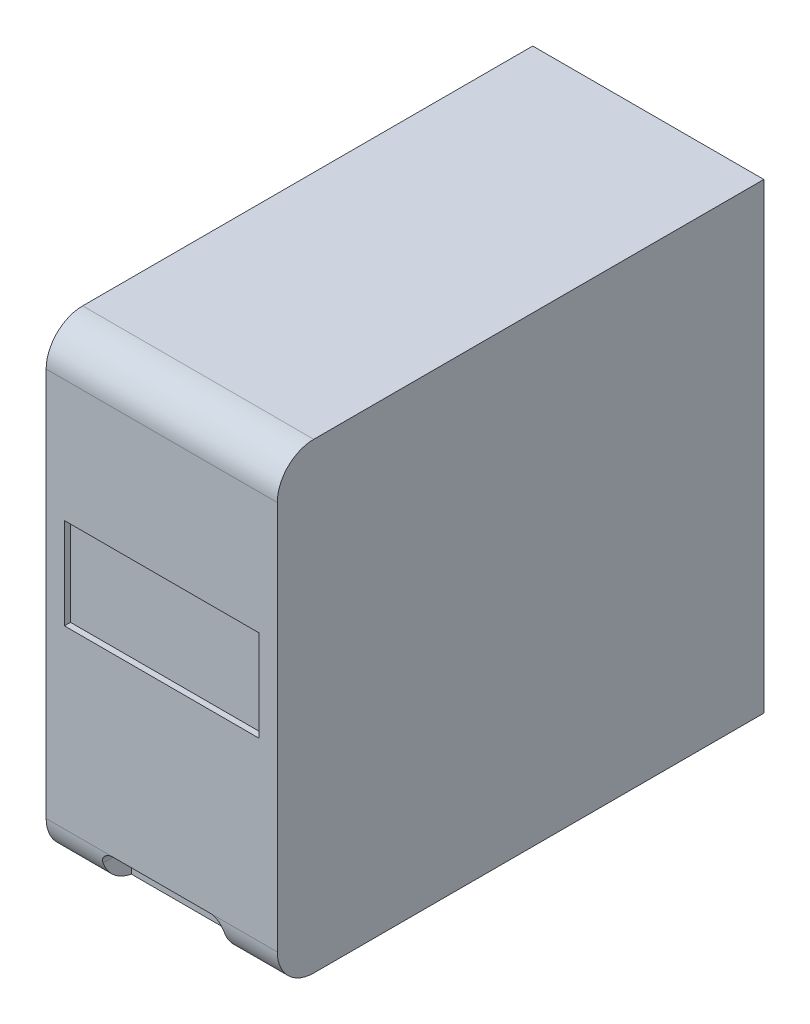
ISO-10303-21;
HEADER;
FILE_DESCRIPTION(('STEP AP214'),'2;1');
FILE_NAME('part.step','',(''),(''),'','','');
FILE_SCHEMA(('AUTOMOTIVE_DESIGN { 1 0 10303 214 1 1 1 1 }'));
ENDSEC;
DATA;
#1=APPLICATION_CONTEXT('core data for automotive mechanical design processes');
#2=APPLICATION_PROTOCOL_DEFINITION('international standard','automotive_design',2000,#1);
#3=PRODUCT_CONTEXT('',#1,'mechanical');
#4=PRODUCT('Part','Part','',(#3));
#5=PRODUCT_RELATED_PRODUCT_CATEGORY('part','',(#4));
#6=PRODUCT_DEFINITION_FORMATION('','',#4);
#7=PRODUCT_DEFINITION_CONTEXT('part definition',#1,'design');
#8=PRODUCT_DEFINITION('design','',#6,#7);
#9=PRODUCT_DEFINITION_SHAPE('','',#8);
#10=(LENGTH_UNIT() NAMED_UNIT(*) SI_UNIT(.MILLI.,.METRE.));
#11=(NAMED_UNIT(*) PLANE_ANGLE_UNIT() SI_UNIT($,.RADIAN.));
#12=(NAMED_UNIT(*) SI_UNIT($,.STERADIAN.) SOLID_ANGLE_UNIT());
#13=UNCERTAINTY_MEASURE_WITH_UNIT(LENGTH_MEASURE(1.E-05),#10,'distance_accuracy_value','');
#14=(GEOMETRIC_REPRESENTATION_CONTEXT(3) GLOBAL_UNCERTAINTY_ASSIGNED_CONTEXT((#13)) GLOBAL_UNIT_ASSIGNED_CONTEXT((#10,
#11,#12)) REPRESENTATION_CONTEXT('',''));
#15=CARTESIAN_POINT('',(0.,0.,0.));
#16=DIRECTION('',(0.,0.,1.));
#17=DIRECTION('',(1.,0.,0.));
#18=AXIS2_PLACEMENT_3D('',#15,#16,#17);
#19=CARTESIAN_POINT('',(95.,-190.,200.));
#20=DIRECTION('',(0.,0.,-1.));
#21=DIRECTION('',(-1.,0.,0.));
#22=AXIS2_PLACEMENT_3D('',#19,#20,#21);
#23=PLANE('',#22);
#24=DIRECTION('',(0.,-1.,0.));
#25=VECTOR('',#24,1.);
#26=CARTESIAN_POINT('',(-80.,0.,200.));
#27=LINE('',#26,#25);
#28=CARTESIAN_POINT('',(-80.,59.6719886433791,200.));
#29=VERTEX_POINT('',#28);
#30=CARTESIAN_POINT('',(-80.,-15.3280113566209,200.));
#31=VERTEX_POINT('',#30);
#32=EDGE_CURVE('E194',#29,#31,#27,.T.);
#33=ORIENTED_EDGE('',*,*,#32,.F.);
#34=DIRECTION('',(-1.,0.,0.));
#35=VECTOR('',#34,1.);
#36=CARTESIAN_POINT('',(0.,59.6719886433791,200.));
#37=LINE('',#36,#35);
#38=CARTESIAN_POINT('',(80.,59.6719886433791,200.));
#39=VERTEX_POINT('',#38);
#40=EDGE_CURVE('E60',#39,#29,#37,.T.);
#41=ORIENTED_EDGE('',*,*,#40,.F.);
#42=DIRECTION('',(0.,-1.,0.));
#43=VECTOR('',#42,1.);
#44=CARTESIAN_POINT('',(80.,0.,200.));
#45=LINE('',#44,#43);
#46=CARTESIAN_POINT('',(80.,-15.3280113566209,200.));
#47=VERTEX_POINT('',#46);
#48=EDGE_CURVE('E185',#39,#47,#45,.T.);
#49=ORIENTED_EDGE('',*,*,#48,.T.);
#50=DIRECTION('',(-1.,0.,0.));
#51=VECTOR('',#50,1.);
#52=CARTESIAN_POINT('',(0.,-15.3280113566209,200.));
#53=LINE('',#52,#51);
#54=EDGE_CURVE('E197',#47,#31,#53,.T.);
#55=ORIENTED_EDGE('',*,*,#54,.T.);
#56=EDGE_LOOP('',(#33,#41,#49,#55));
#57=FACE_BOUND('',#56,.T.);
#58=DIRECTION('',(0.,-1.,0.));
#59=VECTOR('',#58,1.);
#60=CARTESIAN_POINT('',(-95.,-190.,200.));
#61=LINE('',#60,#59);
#62=CARTESIAN_POINT('',(-95.,160.,200.));
#63=VERTEX_POINT('',#62);
#64=CARTESIAN_POINT('',(-95.,-160.,200.));
#65=VERTEX_POINT('',#64);
#66=EDGE_CURVE('E204',#63,#65,#61,.T.);
#67=ORIENTED_EDGE('',*,*,#66,.T.);
#68=DIRECTION('',(-1.,0.,0.));
#69=VECTOR('',#68,1.);
#70=CARTESIAN_POINT('',(95.,-160.,200.));
#71=LINE('',#70,#69);
#72=CARTESIAN_POINT('',(-40.,-160.,200.));
#73=VERTEX_POINT('',#72);
#74=EDGE_CURVE('E246',#65,#73,#71,.F.);
#75=ORIENTED_EDGE('',*,*,#74,.T.);
#76=DIRECTION('',(-1.,0.,0.));
#77=VECTOR('',#76,1.);
#78=CARTESIAN_POINT('',(40.,-160.,200.));
#79=LINE('',#78,#77);
#80=CARTESIAN_POINT('',(40.,-160.,200.));
#81=VERTEX_POINT('',#80);
#82=EDGE_CURVE('E155',#81,#73,#79,.T.);
#83=ORIENTED_EDGE('',*,*,#82,.F.);
#84=CARTESIAN_POINT('',(95.,-160.,200.));
#85=VERTEX_POINT('',#84);
#86=EDGE_CURVE('E245',#81,#85,#71,.F.);
#87=ORIENTED_EDGE('',*,*,#86,.T.);
#88=DIRECTION('',(0.,-1.,0.));
#89=VECTOR('',#88,1.);
#90=CARTESIAN_POINT('',(95.,-190.,200.));
#91=LINE('',#90,#89);
#92=CARTESIAN_POINT('',(95.,160.,200.));
#93=VERTEX_POINT('',#92);
#94=EDGE_CURVE('E210',#93,#85,#91,.T.);
#95=ORIENTED_EDGE('',*,*,#94,.F.);
#96=DIRECTION('',(-1.,0.,0.));
#97=VECTOR('',#96,1.);
#98=CARTESIAN_POINT('',(95.,160.,200.));
#99=LINE('',#98,#97);
#100=EDGE_CURVE('E242',#93,#63,#99,.T.);
#101=ORIENTED_EDGE('',*,*,#100,.T.);
#102=EDGE_LOOP('',(#67,#75,#83,#87,#95,#101));
#103=FACE_BOUND('',#102,.T.);
#104=ADVANCED_FACE('F33',(#57,#103),#23,.F.);
#105=CARTESIAN_POINT('',(95.,-190.,-200.));
#106=DIRECTION('',(0.,1.,0.));
#107=DIRECTION('',(0.,0.,1.));
#108=AXIS2_PLACEMENT_3D('',#105,#106,#107);
#109=PLANE('',#108);
#110=DIRECTION('',(0.,0.,-1.));
#111=VECTOR('',#110,1.);
#112=CARTESIAN_POINT('',(95.,-190.,-200.));
#113=LINE('',#112,#111);
#114=CARTESIAN_POINT('',(95.,-190.,170.));
#115=VERTEX_POINT('',#114);
#116=CARTESIAN_POINT('',(95.,-190.,-200.));
#117=VERTEX_POINT('',#116);
#118=EDGE_CURVE('E213',#115,#117,#113,.T.);
#119=ORIENTED_EDGE('',*,*,#118,.F.);
#120=DIRECTION('',(-1.,0.,0.));
#121=VECTOR('',#120,1.);
#122=CARTESIAN_POINT('',(95.,-190.,170.));
#123=LINE('',#122,#121);
#124=CARTESIAN_POINT('',(-95.,-190.,170.));
#125=VERTEX_POINT('',#124);
#126=EDGE_CURVE('E235',#115,#125,#123,.T.);
#127=ORIENTED_EDGE('',*,*,#126,.T.);
#128=DIRECTION('',(0.,0.,-1.));
#129=VECTOR('',#128,1.);
#130=CARTESIAN_POINT('',(-95.,-190.,-200.));
#131=LINE('',#130,#129);
#132=CARTESIAN_POINT('',(-95.,-190.,-200.));
#133=VERTEX_POINT('',#132);
#134=EDGE_CURVE('E224',#125,#133,#131,.T.);
#135=ORIENTED_EDGE('',*,*,#134,.T.);
#136=DIRECTION('',(-1.,0.,0.));
#137=VECTOR('',#136,1.);
#138=CARTESIAN_POINT('',(95.,-190.,-200.));
#139=LINE('',#138,#137);
#140=EDGE_CURVE('E232',#117,#133,#139,.T.);
#141=ORIENTED_EDGE('',*,*,#140,.F.);
#142=EDGE_LOOP('',(#119,#127,#135,#141));
#143=FACE_BOUND('',#142,.T.);
#144=ADVANCED_FACE('F307',(#143),#109,.F.);
#145=CARTESIAN_POINT('',(95.,-190.,-200.));
#146=DIRECTION('',(0.,0.,1.));
#147=DIRECTION('',(1.,0.,0.));
#148=AXIS2_PLACEMENT_3D('',#145,#146,#147);
#149=PLANE('',#148);
#150=DIRECTION('',(0.,1.,0.));
#151=VECTOR('',#150,1.);
#152=CARTESIAN_POINT('',(-95.,-190.,-200.));
#153=LINE('',#152,#151);
#154=CARTESIAN_POINT('',(-95.,190.,-200.));
#155=VERTEX_POINT('',#154);
#156=EDGE_CURVE('E226',#133,#155,#153,.T.);
#157=ORIENTED_EDGE('',*,*,#156,.T.);
#158=DIRECTION('',(-1.,0.,0.));
#159=VECTOR('',#158,1.);
#160=CARTESIAN_POINT('',(95.,190.,-200.));
#161=LINE('',#160,#159);
#162=CARTESIAN_POINT('',(95.,190.,-200.));
#163=VERTEX_POINT('',#162);
#164=EDGE_CURVE('E221',#163,#155,#161,.T.);
#165=ORIENTED_EDGE('',*,*,#164,.F.);
#166=DIRECTION('',(0.,1.,0.));
#167=VECTOR('',#166,1.);
#168=CARTESIAN_POINT('',(95.,-190.,-200.));
#169=LINE('',#168,#167);
#170=EDGE_CURVE('E216',#117,#163,#169,.T.);
#171=ORIENTED_EDGE('',*,*,#170,.F.);
#172=ORIENTED_EDGE('',*,*,#140,.T.);
#173=EDGE_LOOP('',(#157,#165,#171,#172));
#174=FACE_BOUND('',#173,.T.);
#175=ADVANCED_FACE('F303',(#174),#149,.F.);
#176=CARTESIAN_POINT('',(95.,190.,-200.));
#177=DIRECTION('',(0.,-1.,0.));
#178=DIRECTION('',(0.,0.,-1.));
#179=AXIS2_PLACEMENT_3D('',#176,#177,#178);
#180=PLANE('',#179);
#181=DIRECTION('',(0.,0.,1.));
#182=VECTOR('',#181,1.);
#183=CARTESIAN_POINT('',(-95.,190.,-200.));
#184=LINE('',#183,#182);
#185=CARTESIAN_POINT('',(-95.,190.,170.));
#186=VERTEX_POINT('',#185);
#187=EDGE_CURVE('E214',#155,#186,#184,.T.);
#188=ORIENTED_EDGE('',*,*,#187,.T.);
#189=DIRECTION('',(-1.,0.,0.));
#190=VECTOR('',#189,1.);
#191=CARTESIAN_POINT('',(95.,190.,170.));
#192=LINE('',#191,#190);
#193=CARTESIAN_POINT('',(95.,190.,170.));
#194=VERTEX_POINT('',#193);
#195=EDGE_CURVE('E253',#186,#194,#192,.F.);
#196=ORIENTED_EDGE('',*,*,#195,.T.);
#197=DIRECTION('',(0.,0.,1.));
#198=VECTOR('',#197,1.);
#199=CARTESIAN_POINT('',(95.,190.,-200.));
#200=LINE('',#199,#198);
#201=EDGE_CURVE('E218',#163,#194,#200,.T.);
#202=ORIENTED_EDGE('',*,*,#201,.F.);
#203=ORIENTED_EDGE('',*,*,#164,.T.);
#204=EDGE_LOOP('',(#188,#196,#202,#203));
#205=FACE_BOUND('',#204,.T.);
#206=ADVANCED_FACE('F296',(#205),#180,.F.);
#207=CARTESIAN_POINT('',(95.,0.,0.));
#208=DIRECTION('',(1.,0.,0.));
#209=DIRECTION('',(0.,0.,-1.));
#210=AXIS2_PLACEMENT_3D('',#207,#208,#209);
#211=PLANE('',#210);
#212=ORIENTED_EDGE('',*,*,#94,.T.);
#213=CARTESIAN_POINT('',(95.,-160.,170.));
#214=DIRECTION('',(1.,0.,0.));
#215=DIRECTION('',(0.,0.,-1.));
#216=AXIS2_PLACEMENT_3D('',#213,#214,#215);
#217=CIRCLE('',#216,30.);
#218=EDGE_CURVE('E251',#85,#115,#217,.T.);
#219=ORIENTED_EDGE('',*,*,#218,.T.);
#220=ORIENTED_EDGE('',*,*,#118,.T.);
#221=ORIENTED_EDGE('',*,*,#170,.T.);
#222=ORIENTED_EDGE('',*,*,#201,.T.);
#223=CARTESIAN_POINT('',(95.,160.,170.));
#224=DIRECTION('',(1.,0.,0.));
#225=DIRECTION('',(0.,0.,-1.));
#226=AXIS2_PLACEMENT_3D('',#223,#224,#225);
#227=CIRCLE('',#226,30.);
#228=EDGE_CURVE('E249',#194,#93,#227,.T.);
#229=ORIENTED_EDGE('',*,*,#228,.T.);
#230=EDGE_LOOP('',(#212,#219,#220,#221,#222,#229));
#231=FACE_BOUND('',#230,.T.);
#232=ADVANCED_FACE('F292',(#231),#211,.T.);
#233=CARTESIAN_POINT('',(-95.,0.,0.));
#234=DIRECTION('',(1.,0.,0.));
#235=DIRECTION('',(0.,0.,-1.));
#236=AXIS2_PLACEMENT_3D('',#233,#234,#235);
#237=PLANE('',#236);
#238=ORIENTED_EDGE('',*,*,#134,.F.);
#239=CARTESIAN_POINT('',(-95.,-160.,170.));
#240=DIRECTION('',(1.,0.,0.));
#241=DIRECTION('',(0.,0.,-1.));
#242=AXIS2_PLACEMENT_3D('',#239,#240,#241);
#243=CIRCLE('',#242,30.);
#244=EDGE_CURVE('E240',#125,#65,#243,.F.);
#245=ORIENTED_EDGE('',*,*,#244,.T.);
#246=ORIENTED_EDGE('',*,*,#66,.F.);
#247=CARTESIAN_POINT('',(-95.,160.,170.));
#248=DIRECTION('',(1.,0.,0.));
#249=DIRECTION('',(0.,0.,-1.));
#250=AXIS2_PLACEMENT_3D('',#247,#248,#249);
#251=CIRCLE('',#250,30.);
#252=EDGE_CURVE('E238',#63,#186,#251,.F.);
#253=ORIENTED_EDGE('',*,*,#252,.T.);
#254=ORIENTED_EDGE('',*,*,#187,.F.);
#255=ORIENTED_EDGE('',*,*,#156,.F.);
#256=EDGE_LOOP('',(#238,#245,#246,#253,#254,#255));
#257=FACE_BOUND('',#256,.T.);
#258=ADVANCED_FACE('F295',(#257),#237,.F.);
#259=CARTESIAN_POINT('',(95.,-160.,170.));
#260=DIRECTION('',(-1.,0.,0.));
#261=DIRECTION('',(0.,0.,1.));
#262=AXIS2_PLACEMENT_3D('',#259,#260,#261);
#263=CYLINDRICAL_SURFACE('',#262,30.);
#264=CARTESIAN_POINT('',(-40.,-160.,200.));
#265=CARTESIAN_POINT('',(-40.28095100053,-159.999969889423,199.999970330303));
#266=CARTESIAN_POINT('',(-40.5618977001833,-160.011838758226,199.999999068018));
#267=CARTESIAN_POINT('',(-41.1217866671126,-160.059157077855,199.999958929646));
#268=CARTESIAN_POINT('',(-41.400729020641,-160.09460550777,199.999890057785));
#269=CARTESIAN_POINT('',(-41.9544831051373,-160.188839225973,199.999440432078));
#270=CARTESIAN_POINT('',(-42.2292970608852,-160.247611439966,199.999059852834));
#271=CARTESIAN_POINT('',(-42.7730013547145,-160.388065422842,199.997572677254));
#272=CARTESIAN_POINT('',(-43.0418917655821,-160.469746910056,199.996466089844));
#273=CARTESIAN_POINT('',(-43.5719882637669,-160.655492403126,199.992981619503));
#274=CARTESIAN_POINT('',(-43.8331899896401,-160.759568844708,199.990603029144));
#275=CARTESIAN_POINT('',(-44.3458845871562,-160.989328748389,199.983902864841));
#276=CARTESIAN_POINT('',(-44.5973775254464,-161.115012062132,199.979581304236));
#277=CARTESIAN_POINT('',(-45.088812856191,-161.387053319962,199.968226569172));
#278=CARTESIAN_POINT('',(-45.3287568877028,-161.53340831859,199.961193780783));
#279=CARTESIAN_POINT('',(-45.7953913314118,-161.845721475575,199.943576328422));
#280=CARTESIAN_POINT('',(-46.0220818843529,-162.011679425704,199.932991702177));
#281=CARTESIAN_POINT('',(-46.4595451002094,-162.361133063608,199.907450405961));
#282=CARTESIAN_POINT('',(-46.6703862162291,-162.5445445281,199.892514080274));
#283=CARTESIAN_POINT('',(-47.0757636311216,-162.928123838934,199.857380488216));
#284=CARTESIAN_POINT('',(-47.2702999134347,-163.128291702293,199.837183216501));
#285=CARTESIAN_POINT('',(-47.6416139501458,-163.543736774259,199.790696471024));
#286=CARTESIAN_POINT('',(-47.8183957163205,-163.759010550804,199.764408377992));
#287=CARTESIAN_POINT('',(-48.1529906694208,-164.202932425007,199.704974198699));
#288=CARTESIAN_POINT('',(-48.3108043985026,-164.431580140125,199.671828308525));
#289=CARTESIAN_POINT('',(-48.6036074126578,-164.895899057553,199.598722153749));
#290=CARTESIAN_POINT('',(-48.7389712006718,-165.131356310949,199.558902278641));
#291=CARTESIAN_POINT('',(-48.9896150429259,-165.611363861628,199.471547180037));
#292=CARTESIAN_POINT('',(-49.1048945592361,-165.855914402251,199.424011749956));
#293=CARTESIAN_POINT('',(-49.3148072998489,-166.352129269028,199.320891601089));
#294=CARTESIAN_POINT('',(-49.4094363048133,-166.603795037132,199.26530524118));
#295=CARTESIAN_POINT('',(-49.5776731254438,-167.11212384551,199.145939987937));
#296=CARTESIAN_POINT('',(-49.6512843085371,-167.368786078217,199.082162409357));
#297=CARTESIAN_POINT('',(-49.7624038787947,-167.82364796698,198.962595761663));
#298=CARTESIAN_POINT('',(-49.8043349470949,-168.021232375529,198.908514871608));
#299=CARTESIAN_POINT('',(-49.8760023344919,-168.417261695051,198.795695656681));
#300=CARTESIAN_POINT('',(-49.9057401539366,-168.615706497117,198.736957905887));
#301=CARTESIAN_POINT('',(-49.9531001112375,-169.012276749848,198.615062171224));
#302=CARTESIAN_POINT('',(-49.9707440795928,-169.210402128463,198.551912379845));
#303=CARTESIAN_POINT('',(-49.994198630746,-169.605932979501,198.421287750671));
#304=CARTESIAN_POINT('',(-50.0000089682899,-169.803338436918,198.353812823267));
#305=CARTESIAN_POINT('',(-50.,-170.,198.284271247462));
#306=B_SPLINE_CURVE_WITH_KNOTS('',3,(#264,#265,#266,#267,#268,#269,#270,#271,#272,#273,#274,
#275,#276,#277,#278,#279,#280,#281,#282,#283,#284,#285,#286,#287,#288,#289,#290,#291,#292,#293,
#294,#295,#296,#297,#298,#299,#300,#301,#302,#303,#304,#305),.UNSPECIFIED.,.F.,.F.,(4,2,2,2,2,2,
2,2,2,2,2,2,2,2,2,2,2,2,2,2,4),(0.,0.842596347235416,1.68515621545009,2.52724444704607,
3.36932232562103,4.21186901508965,5.0544099197368,5.8968308935731,6.73924291978504,
7.57777817081019,8.41631427345932,9.25466047376526,10.0929827062405,10.9154858227551,
11.7380109655107,12.5607040106039,13.3832651716468,14.0101734935271,14.6370046527931,
15.2627013239029,15.8884109625542),.UNSPECIFIED.);
#307=CARTESIAN_POINT('',(-50.,-170.,198.284271247462));
#308=VERTEX_POINT('',#307);
#309=EDGE_CURVE('E11',#73,#308,#306,.T.);
#310=ORIENTED_EDGE('',*,*,#309,.F.);
#311=ORIENTED_EDGE('',*,*,#74,.F.);
#312=ORIENTED_EDGE('',*,*,#244,.F.);
#313=ORIENTED_EDGE('',*,*,#126,.F.);
#314=ORIENTED_EDGE('',*,*,#218,.F.);
#315=ORIENTED_EDGE('',*,*,#86,.F.);
#316=CARTESIAN_POINT('',(50.,-170.,198.284271247462));
#317=CARTESIAN_POINT('',(50.0000320928327,-169.736208972423,198.377572886787));
#318=CARTESIAN_POINT('',(49.989562346357,-169.471050423097,198.467132414141));
#319=CARTESIAN_POINT('',(49.9472048255618,-168.939825708577,198.638380802605));
#320=CARTESIAN_POINT('',(49.9153109035706,-168.673759304684,198.720067396879));
#321=CARTESIAN_POINT('',(49.8296857842549,-168.14267260188,198.875137420559));
#322=CARTESIAN_POINT('',(49.7759523381867,-167.877652413532,198.948519993931));
#323=CARTESIAN_POINT('',(49.6465175393751,-167.350800262793,199.086764351863));
#324=CARTESIAN_POINT('',(49.570818792215,-167.088967926087,199.151627145736));
#325=CARTESIAN_POINT('',(49.3973545406745,-166.570022628021,199.272956528182));
#326=CARTESIAN_POINT('',(49.2995394243366,-166.3129217045,199.329403758947));
#327=CARTESIAN_POINT('',(49.0823131954279,-165.80624748487,199.433898889602));
#328=CARTESIAN_POINT('',(48.9629024402555,-165.556674064265,199.481946928468));
#329=CARTESIAN_POINT('',(48.7032154510401,-165.067384452854,199.569974129532));
#330=CARTESIAN_POINT('',(48.562954529976,-164.827661191351,199.609959163075));
#331=CARTESIAN_POINT('',(48.2623872891451,-164.359944408242,199.682434137817));
#332=CARTESIAN_POINT('',(48.1020816016482,-164.131950516977,199.714924315335));
#333=CARTESIAN_POINT('',(47.7672723589595,-163.695799684116,199.772270648436));
#334=CARTESIAN_POINT('',(47.5932906284361,-163.487266481761,199.797314733996));
#335=CARTESIAN_POINT('',(47.2286049076774,-163.084725001836,199.841673586902));
#336=CARTESIAN_POINT('',(47.0379011390645,-162.890716531828,199.860988430166));
#337=CARTESIAN_POINT('',(46.641007314041,-162.518619893645,199.894673054857));
#338=CARTESIAN_POINT('',(46.43481123548,-162.340537975951,199.909040901052));
#339=CARTESIAN_POINT('',(46.0084241548038,-162.001687820095,199.933628450655));
#340=CARTESIAN_POINT('',(45.7882330930205,-161.840919655758,199.943848136375));
#341=CARTESIAN_POINT('',(45.3329759922878,-161.536243137958,199.96103291897));
#342=CARTESIAN_POINT('',(45.0977773115031,-161.392530982555,199.967962468242));
#343=CARTESIAN_POINT('',(44.616272250787,-161.12498518072,199.97919853529));
#344=CARTESIAN_POINT('',(44.3699657566459,-161.001151738739,199.983505026089));
#345=CARTESIAN_POINT('',(43.8680200167025,-160.774260737807,199.990221809384));
#346=CARTESIAN_POINT('',(43.6123831898947,-160.671197838417,199.992632589761));
#347=CARTESIAN_POINT('',(43.0934921837441,-160.486529594857,199.996196930315));
#348=CARTESIAN_POINT('',(42.8302391386293,-160.404921073716,199.997350676713));
#349=CARTESIAN_POINT('',(42.3551175301922,-160.278879409757,199.998754670982));
#350=CARTESIAN_POINT('',(42.1443572060037,-160.230226355665,199.999145753508));
#351=CARTESIAN_POINT('',(41.7201484264248,-160.14668529873,199.999670381541));
#352=CARTESIAN_POINT('',(41.5067003750377,-160.111795252011,199.999803965301));
#353=CARTESIAN_POINT('',(41.0781796967767,-160.055948318897,199.999961551061));
#354=CARTESIAN_POINT('',(40.8631086358938,-160.034979399284,199.999985647806));
#355=CARTESIAN_POINT('',(40.4320259364395,-160.006998993898,199.999999666965));
#356=CARTESIAN_POINT('',(40.2160141521956,-159.999989752839,199.999989583885));
#357=CARTESIAN_POINT('',(40.,-160.,200.));
#358=B_SPLINE_CURVE_WITH_KNOTS('',3,(#316,#317,#318,#319,#320,#321,#322,#323,#324,#325,#326,
#327,#328,#329,#330,#331,#332,#333,#334,#335,#336,#337,#338,#339,#340,#341,#342,#343,#344,#345,
#346,#347,#348,#349,#350,#351,#352,#353,#354,#355,#356,#357),.UNSPECIFIED.,.F.,.F.,(4,2,2,2,2,2,
2,2,2,2,2,2,2,2,2,2,2,2,2,2,4),(0.,0.839252815331729,1.67874655737015,2.51832676121381,
3.35780741247371,4.19919022565456,5.04055911559604,5.8813131046223,6.72204058051576,
7.539278325486,8.35650524099357,9.17405148798559,9.991601220844,10.817793586409,
11.6439944487636,12.4699826098721,13.29584838941,13.9443264567143,14.592708185397,
15.2405287302226,15.8884534360988),.UNSPECIFIED.);
#359=CARTESIAN_POINT('',(50.,-170.,198.284271247462));
#360=VERTEX_POINT('',#359);
#361=EDGE_CURVE('E257',#360,#81,#358,.T.);
#362=ORIENTED_EDGE('',*,*,#361,.F.);
#363=CARTESIAN_POINT('',(50.,-160.,170.));
#364=DIRECTION('',(1.,0.,0.));
#365=DIRECTION('',(0.,1.,0.));
#366=AXIS2_PLACEMENT_3D('',#363,#364,#365);
#367=CIRCLE('',#366,30.);
#368=CARTESIAN_POINT('',(50.,-189.580398915498,175.));
#369=VERTEX_POINT('',#368);
#370=EDGE_CURVE('E160',#369,#360,#367,.F.);
#371=ORIENTED_EDGE('',*,*,#370,.F.);
#372=DIRECTION('',(-1.,0.,0.));
#373=VECTOR('',#372,1.);
#374=CARTESIAN_POINT('',(95.,-189.580398915498,175.));
#375=LINE('',#374,#373);
#376=CARTESIAN_POINT('',(-50.,-189.580398915498,175.));
#377=VERTEX_POINT('',#376);
#378=EDGE_CURVE('E152',#369,#377,#375,.T.);
#379=ORIENTED_EDGE('',*,*,#378,.T.);
#380=CARTESIAN_POINT('',(-50.,-160.,170.));
#381=DIRECTION('',(-1.,0.,0.));
#382=DIRECTION('',(0.,0.,1.));
#383=AXIS2_PLACEMENT_3D('',#380,#381,#382);
#384=CIRCLE('',#383,30.);
#385=EDGE_CURVE('E45',#308,#377,#384,.F.);
#386=ORIENTED_EDGE('',*,*,#385,.F.);
#387=EDGE_LOOP('',(#310,#311,#312,#313,#314,#315,#362,#371,#379,#386));
#388=FACE_BOUND('',#387,.T.);
#389=ADVANCED_FACE('F262',(#388),#263,.T.);
#390=CARTESIAN_POINT('',(95.,160.,170.));
#391=DIRECTION('',(-1.,0.,0.));
#392=DIRECTION('',(0.,0.,1.));
#393=AXIS2_PLACEMENT_3D('',#390,#391,#392);
#394=CYLINDRICAL_SURFACE('',#393,30.);
#395=ORIENTED_EDGE('',*,*,#228,.F.);
#396=ORIENTED_EDGE('',*,*,#195,.F.);
#397=ORIENTED_EDGE('',*,*,#252,.F.);
#398=ORIENTED_EDGE('',*,*,#100,.F.);
#399=EDGE_LOOP('',(#395,#396,#397,#398));
#400=FACE_BOUND('',#399,.T.);
#401=ADVANCED_FACE('F35',(#400),#394,.T.);
#402=CARTESIAN_POINT('',(0.,59.6719886433791,195.));
#403=DIRECTION('',(0.,1.,0.));
#404=DIRECTION('',(-1.,0.,0.));
#405=AXIS2_PLACEMENT_3D('',#402,#403,#404);
#406=PLANE('',#405);
#407=ORIENTED_EDGE('',*,*,#40,.T.);
#408=DIRECTION('',(0.,0.,1.));
#409=VECTOR('',#408,1.);
#410=CARTESIAN_POINT('',(-80.,59.6719886433791,195.));
#411=LINE('',#410,#409);
#412=CARTESIAN_POINT('',(-80.,59.6719886433791,195.));
#413=VERTEX_POINT('',#412);
#414=EDGE_CURVE('E192',#413,#29,#411,.T.);
#415=ORIENTED_EDGE('',*,*,#414,.F.);
#416=DIRECTION('',(-1.,0.,0.));
#417=VECTOR('',#416,1.);
#418=CARTESIAN_POINT('',(0.,59.6719886433791,195.));
#419=LINE('',#418,#417);
#420=CARTESIAN_POINT('',(80.,59.6719886433791,195.));
#421=VERTEX_POINT('',#420);
#422=EDGE_CURVE('E181',#421,#413,#419,.T.);
#423=ORIENTED_EDGE('',*,*,#422,.F.);
#424=DIRECTION('',(0.,0.,1.));
#425=VECTOR('',#424,1.);
#426=CARTESIAN_POINT('',(80.,59.6719886433791,195.));
#427=LINE('',#426,#425);
#428=EDGE_CURVE('E202',#421,#39,#427,.T.);
#429=ORIENTED_EDGE('',*,*,#428,.T.);
#430=EDGE_LOOP('',(#407,#415,#423,#429));
#431=FACE_BOUND('',#430,.T.);
#432=ADVANCED_FACE('F282',(#431),#406,.F.);
#433=CARTESIAN_POINT('',(80.,0.,195.));
#434=DIRECTION('',(-1.,0.,0.));
#435=DIRECTION('',(0.,-1.,0.));
#436=AXIS2_PLACEMENT_3D('',#433,#434,#435);
#437=PLANE('',#436);
#438=ORIENTED_EDGE('',*,*,#48,.F.);
#439=ORIENTED_EDGE('',*,*,#428,.F.);
#440=DIRECTION('',(0.,-1.,0.));
#441=VECTOR('',#440,1.);
#442=CARTESIAN_POINT('',(80.,0.,195.));
#443=LINE('',#442,#441);
#444=CARTESIAN_POINT('',(80.,-15.3280113566209,195.));
#445=VERTEX_POINT('',#444);
#446=EDGE_CURVE('E190',#421,#445,#443,.T.);
#447=ORIENTED_EDGE('',*,*,#446,.T.);
#448=DIRECTION('',(0.,0.,1.));
#449=VECTOR('',#448,1.);
#450=CARTESIAN_POINT('',(80.,-15.3280113566209,195.));
#451=LINE('',#450,#449);
#452=EDGE_CURVE('E205',#445,#47,#451,.T.);
#453=ORIENTED_EDGE('',*,*,#452,.T.);
#454=EDGE_LOOP('',(#438,#439,#447,#453));
#455=FACE_BOUND('',#454,.T.);
#456=ADVANCED_FACE('F278',(#455),#437,.T.);
#457=CARTESIAN_POINT('',(0.,-15.3280113566209,195.));
#458=DIRECTION('',(0.,1.,0.));
#459=DIRECTION('',(-1.,0.,0.));
#460=AXIS2_PLACEMENT_3D('',#457,#458,#459);
#461=PLANE('',#460);
#462=ORIENTED_EDGE('',*,*,#54,.F.);
#463=ORIENTED_EDGE('',*,*,#452,.F.);
#464=DIRECTION('',(-1.,0.,0.));
#465=VECTOR('',#464,1.);
#466=CARTESIAN_POINT('',(0.,-15.3280113566209,195.));
#467=LINE('',#466,#465);
#468=CARTESIAN_POINT('',(-80.,-15.3280113566209,195.));
#469=VERTEX_POINT('',#468);
#470=EDGE_CURVE('E188',#445,#469,#467,.T.);
#471=ORIENTED_EDGE('',*,*,#470,.T.);
#472=DIRECTION('',(0.,0.,1.));
#473=VECTOR('',#472,1.);
#474=CARTESIAN_POINT('',(-80.,-15.3280113566209,195.));
#475=LINE('',#474,#473);
#476=EDGE_CURVE('E207',#469,#31,#475,.T.);
#477=ORIENTED_EDGE('',*,*,#476,.T.);
#478=EDGE_LOOP('',(#462,#463,#471,#477));
#479=FACE_BOUND('',#478,.T.);
#480=ADVANCED_FACE('F281',(#479),#461,.T.);
#481=CARTESIAN_POINT('',(-80.,0.,195.));
#482=DIRECTION('',(-1.,0.,0.));
#483=DIRECTION('',(0.,-1.,0.));
#484=AXIS2_PLACEMENT_3D('',#481,#482,#483);
#485=PLANE('',#484);
#486=ORIENTED_EDGE('',*,*,#32,.T.);
#487=ORIENTED_EDGE('',*,*,#476,.F.);
#488=DIRECTION('',(0.,-1.,0.));
#489=VECTOR('',#488,1.);
#490=CARTESIAN_POINT('',(-80.,0.,195.));
#491=LINE('',#490,#489);
#492=EDGE_CURVE('E184',#413,#469,#491,.T.);
#493=ORIENTED_EDGE('',*,*,#492,.F.);
#494=ORIENTED_EDGE('',*,*,#414,.T.);
#495=EDGE_LOOP('',(#486,#487,#493,#494));
#496=FACE_BOUND('',#495,.T.);
#497=ADVANCED_FACE('F276',(#496),#485,.F.);
#498=CARTESIAN_POINT('',(0.,0.,195.));
#499=DIRECTION('',(0.,0.,1.));
#500=DIRECTION('',(1.,0.,0.));
#501=AXIS2_PLACEMENT_3D('',#498,#499,#500);
#502=PLANE('',#501);
#503=ORIENTED_EDGE('',*,*,#422,.T.);
#504=ORIENTED_EDGE('',*,*,#492,.T.);
#505=ORIENTED_EDGE('',*,*,#470,.F.);
#506=ORIENTED_EDGE('',*,*,#446,.F.);
#507=EDGE_LOOP('',(#503,#504,#505,#506));
#508=FACE_BOUND('',#507,.T.);
#509=ADVANCED_FACE('F272',(#508),#502,.T.);
#510=CARTESIAN_POINT('',(-50.,-170.,175.));
#511=DIRECTION('',(-1.,0.,0.));
#512=DIRECTION('',(0.,0.,1.));
#513=AXIS2_PLACEMENT_3D('',#510,#511,#512);
#514=PLANE('',#513);
#515=ORIENTED_EDGE('',*,*,#385,.T.);
#516=DIRECTION('',(0.,-1.,0.));
#517=VECTOR('',#516,1.);
#518=CARTESIAN_POINT('',(-50.,-170.,175.));
#519=LINE('',#518,#517);
#520=CARTESIAN_POINT('',(-50.,-170.,175.));
#521=VERTEX_POINT('',#520);
#522=EDGE_CURVE('E163',#521,#377,#519,.T.);
#523=ORIENTED_EDGE('',*,*,#522,.F.);
#524=DIRECTION('',(0.,0.,1.));
#525=VECTOR('',#524,1.);
#526=CARTESIAN_POINT('',(-50.,-170.,175.));
#527=LINE('',#526,#525);
#528=EDGE_CURVE('E175',#521,#308,#527,.T.);
#529=ORIENTED_EDGE('',*,*,#528,.T.);
#530=EDGE_LOOP('',(#515,#523,#529));
#531=FACE_BOUND('',#530,.T.);
#532=ADVANCED_FACE('F275',(#531),#514,.F.);
#533=CARTESIAN_POINT('',(-40.,-170.,175.));
#534=DIRECTION('',(0.,0.,1.));
#535=DIRECTION('',(1.,0.,0.));
#536=AXIS2_PLACEMENT_3D('',#533,#534,#535);
#537=CYLINDRICAL_SURFACE('',#536,10.);
#538=ORIENTED_EDGE('',*,*,#309,.T.);
#539=ORIENTED_EDGE('',*,*,#528,.F.);
#540=CARTESIAN_POINT('',(-40.,-170.,175.));
#541=DIRECTION('',(0.,0.,1.));
#542=DIRECTION('',(1.,0.,0.));
#543=AXIS2_PLACEMENT_3D('',#540,#541,#542);
#544=CIRCLE('',#543,10.);
#545=CARTESIAN_POINT('',(-40.,-160.,175.));
#546=VERTEX_POINT('',#545);
#547=EDGE_CURVE('E168',#546,#521,#544,.T.);
#548=ORIENTED_EDGE('',*,*,#547,.F.);
#549=DIRECTION('',(0.,0.,1.));
#550=VECTOR('',#549,1.);
#551=CARTESIAN_POINT('',(-40.,-160.,175.));
#552=LINE('',#551,#550);
#553=EDGE_CURVE('E178',#546,#73,#552,.T.);
#554=ORIENTED_EDGE('',*,*,#553,.T.);
#555=EDGE_LOOP('',(#538,#539,#548,#554));
#556=FACE_BOUND('',#555,.T.);
#557=ADVANCED_FACE('F327',(#556),#537,.F.);
#558=CARTESIAN_POINT('',(40.,-160.,175.));
#559=DIRECTION('',(0.,1.,0.));
#560=DIRECTION('',(-1.,0.,0.));
#561=AXIS2_PLACEMENT_3D('',#558,#559,#560);
#562=PLANE('',#561);
#563=ORIENTED_EDGE('',*,*,#82,.T.);
#564=ORIENTED_EDGE('',*,*,#553,.F.);
#565=DIRECTION('',(-1.,0.,0.));
#566=VECTOR('',#565,1.);
#567=CARTESIAN_POINT('',(40.,-160.,175.));
#568=LINE('',#567,#566);
#569=CARTESIAN_POINT('',(40.,-160.,175.));
#570=VERTEX_POINT('',#569);
#571=EDGE_CURVE('E166',#570,#546,#568,.T.);
#572=ORIENTED_EDGE('',*,*,#571,.F.);
#573=DIRECTION('',(0.,0.,1.));
#574=VECTOR('',#573,1.);
#575=CARTESIAN_POINT('',(40.,-160.,175.));
#576=LINE('',#575,#574);
#577=EDGE_CURVE('E52',#570,#81,#576,.T.);
#578=ORIENTED_EDGE('',*,*,#577,.T.);
#579=EDGE_LOOP('',(#563,#564,#572,#578));
#580=FACE_BOUND('',#579,.T.);
#581=ADVANCED_FACE('F269',(#580),#562,.F.);
#582=CARTESIAN_POINT('',(40.,-170.,175.));
#583=DIRECTION('',(0.,0.,1.));
#584=DIRECTION('',(1.,0.,0.));
#585=AXIS2_PLACEMENT_3D('',#582,#583,#584);
#586=CYLINDRICAL_SURFACE('',#585,10.);
#587=ORIENTED_EDGE('',*,*,#361,.T.);
#588=ORIENTED_EDGE('',*,*,#577,.F.);
#589=CARTESIAN_POINT('',(40.,-170.,175.));
#590=DIRECTION('',(0.,0.,1.));
#591=DIRECTION('',(1.,0.,0.));
#592=AXIS2_PLACEMENT_3D('',#589,#590,#591);
#593=CIRCLE('',#592,10.);
#594=CARTESIAN_POINT('',(50.,-170.,175.));
#595=VERTEX_POINT('',#594);
#596=EDGE_CURVE('E149',#595,#570,#593,.T.);
#597=ORIENTED_EDGE('',*,*,#596,.F.);
#598=DIRECTION('',(0.,0.,1.));
#599=VECTOR('',#598,1.);
#600=CARTESIAN_POINT('',(50.,-170.,175.));
#601=LINE('',#600,#599);
#602=EDGE_CURVE('E158',#595,#360,#601,.T.);
#603=ORIENTED_EDGE('',*,*,#602,.T.);
#604=EDGE_LOOP('',(#587,#588,#597,#603));
#605=FACE_BOUND('',#604,.T.);
#606=ADVANCED_FACE('F165',(#605),#586,.F.);
#607=CARTESIAN_POINT('',(50.,-190.,175.));
#608=DIRECTION('',(1.,0.,0.));
#609=DIRECTION('',(0.,1.,0.));
#610=AXIS2_PLACEMENT_3D('',#607,#608,#609);
#611=PLANE('',#610);
#612=ORIENTED_EDGE('',*,*,#370,.T.);
#613=ORIENTED_EDGE('',*,*,#602,.F.);
#614=DIRECTION('',(0.,1.,0.));
#615=VECTOR('',#614,1.);
#616=CARTESIAN_POINT('',(50.,-190.,175.));
#617=LINE('',#616,#615);
#618=EDGE_CURVE('E144',#369,#595,#617,.T.);
#619=ORIENTED_EDGE('',*,*,#618,.F.);
#620=EDGE_LOOP('',(#612,#613,#619));
#621=FACE_BOUND('',#620,.T.);
#622=ADVANCED_FACE('F159',(#621),#611,.F.);
#623=CARTESIAN_POINT('',(40.,-170.,175.));
#624=DIRECTION('',(0.,0.,1.));
#625=DIRECTION('',(1.,0.,0.));
#626=AXIS2_PLACEMENT_3D('',#623,#624,#625);
#627=PLANE('',#626);
#628=ORIENTED_EDGE('',*,*,#618,.T.);
#629=ORIENTED_EDGE('',*,*,#596,.T.);
#630=ORIENTED_EDGE('',*,*,#571,.T.);
#631=ORIENTED_EDGE('',*,*,#547,.T.);
#632=ORIENTED_EDGE('',*,*,#522,.T.);
#633=ORIENTED_EDGE('',*,*,#378,.F.);
#634=EDGE_LOOP('',(#628,#629,#630,#631,#632,#633));
#635=FACE_BOUND('',#634,.T.);
#636=ADVANCED_FACE('F146',(#635),#627,.T.);
#637=CLOSED_SHELL('',(#104,#144,#175,#206,#232,#258,#389,#401,#432,#456,#480,#497,#509,#532,
#557,#581,#606,#622,#636));
#638=MANIFOLD_SOLID_BREP('B2',#637);
#639=ADVANCED_BREP_SHAPE_REPRESENTATION('',(#18,#638),#14);
#640=SHAPE_DEFINITION_REPRESENTATION(#9,#639);
ENDSEC;
END-ISO-10303-21;
